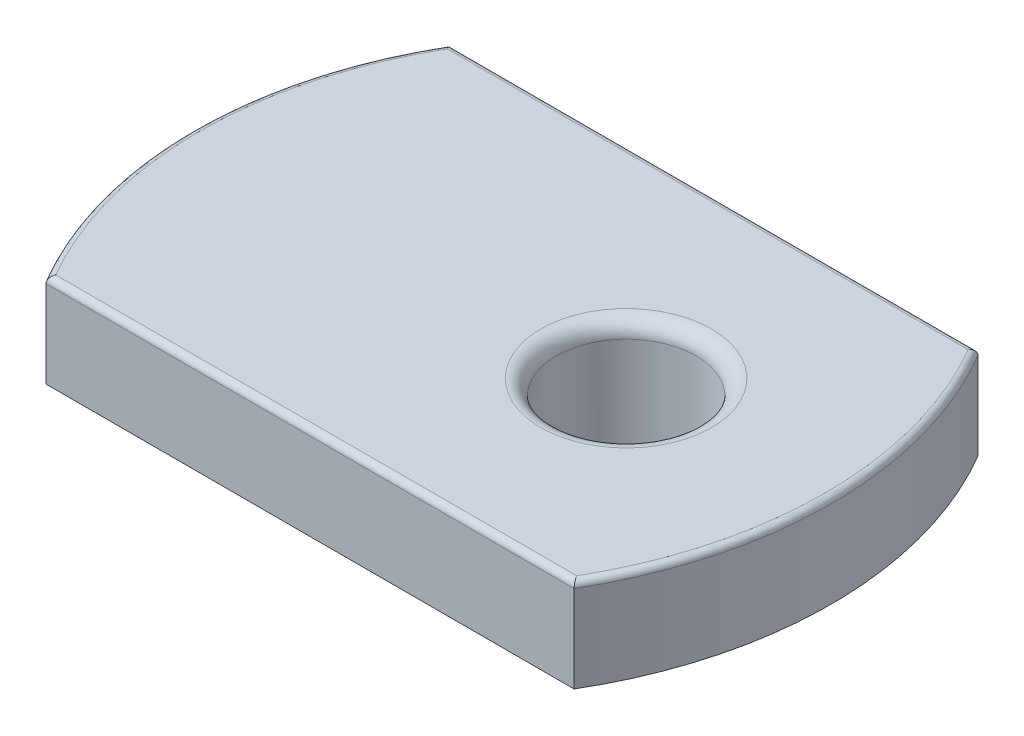
ISO-10303-21;
HEADER;
FILE_DESCRIPTION(('STEP AP214'),'2;1');
FILE_NAME('part.step','',(''),(''),'','','');
FILE_SCHEMA(('AUTOMOTIVE_DESIGN { 1 0 10303 214 1 1 1 1 }'));
ENDSEC;
DATA;
#1=APPLICATION_CONTEXT('core data for automotive mechanical design processes');
#2=APPLICATION_PROTOCOL_DEFINITION('international standard','automotive_design',2000,#1);
#3=PRODUCT_CONTEXT('',#1,'mechanical');
#4=PRODUCT('Part','Part','',(#3));
#5=PRODUCT_RELATED_PRODUCT_CATEGORY('part','',(#4));
#6=PRODUCT_DEFINITION_FORMATION('','',#4);
#7=PRODUCT_DEFINITION_CONTEXT('part definition',#1,'design');
#8=PRODUCT_DEFINITION('design','',#6,#7);
#9=PRODUCT_DEFINITION_SHAPE('','',#8);
#10=(LENGTH_UNIT() NAMED_UNIT(*) SI_UNIT(.MILLI.,.METRE.));
#11=(NAMED_UNIT(*) PLANE_ANGLE_UNIT() SI_UNIT($,.RADIAN.));
#12=(NAMED_UNIT(*) SI_UNIT($,.STERADIAN.) SOLID_ANGLE_UNIT());
#13=UNCERTAINTY_MEASURE_WITH_UNIT(LENGTH_MEASURE(1.E-05),#10,'distance_accuracy_value','');
#14=(GEOMETRIC_REPRESENTATION_CONTEXT(3) GLOBAL_UNCERTAINTY_ASSIGNED_CONTEXT((#13)) GLOBAL_UNIT_ASSIGNED_CONTEXT((#10,
#11,#12)) REPRESENTATION_CONTEXT('',''));
#15=CARTESIAN_POINT('',(0.,0.,0.));
#16=DIRECTION('',(0.,0.,1.));
#17=DIRECTION('',(1.,0.,0.));
#18=AXIS2_PLACEMENT_3D('',#15,#16,#17);
#19=CARTESIAN_POINT('',(-2.51390845070421,3.,0.));
#20=DIRECTION('',(0.,-1.,0.));
#21=DIRECTION('',(0.,0.,-1.));
#22=AXIS2_PLACEMENT_3D('',#19,#20,#21);
#23=CYLINDRICAL_SURFACE('',#22,12.7889084507042);
#24=DIRECTION('',(0.,-1.,0.));
#25=VECTOR('',#24,1.);
#26=CARTESIAN_POINT('',(8.5,3.,-6.5));
#27=LINE('',#26,#25);
#28=CARTESIAN_POINT('',(8.5,2.8,-6.5));
#29=VERTEX_POINT('',#28);
#30=CARTESIAN_POINT('',(8.5,0.,-6.5));
#31=VERTEX_POINT('',#30);
#32=EDGE_CURVE('E72',#29,#31,#27,.T.);
#33=ORIENTED_EDGE('',*,*,#32,.F.);
#34=CARTESIAN_POINT('',(-2.51390845070421,2.8,0.));
#35=DIRECTION('',(0.,-1.,0.));
#36=DIRECTION('',(0.,0.,-1.));
#37=AXIS2_PLACEMENT_3D('',#34,#35,#36);
#38=CIRCLE('',#37,12.7889084507042);
#39=CARTESIAN_POINT('',(8.5,2.8,6.5));
#40=VERTEX_POINT('',#39);
#41=EDGE_CURVE('E132',#29,#40,#38,.T.);
#42=ORIENTED_EDGE('',*,*,#41,.T.);
#43=DIRECTION('',(0.,-1.,0.));
#44=VECTOR('',#43,1.);
#45=CARTESIAN_POINT('',(8.5,3.,6.5));
#46=LINE('',#45,#44);
#47=CARTESIAN_POINT('',(8.5,0.,6.5));
#48=VERTEX_POINT('',#47);
#49=EDGE_CURVE('E92',#40,#48,#46,.T.);
#50=ORIENTED_EDGE('',*,*,#49,.T.);
#51=CARTESIAN_POINT('',(-2.51390845070421,0.,0.));
#52=DIRECTION('',(0.,1.,0.));
#53=DIRECTION('',(0.,0.,-1.));
#54=AXIS2_PLACEMENT_3D('',#51,#52,#53);
#55=CIRCLE('',#54,12.7889084507042);
#56=EDGE_CURVE('E87',#48,#31,#55,.T.);
#57=ORIENTED_EDGE('',*,*,#56,.T.);
#58=EDGE_LOOP('',(#33,#42,#50,#57));
#59=FACE_BOUND('',#58,.T.);
#60=ADVANCED_FACE('F16',(#59),#23,.T.);
#61=CARTESIAN_POINT('',(-8.5,3.,-6.5));
#62=DIRECTION('',(0.,0.,1.));
#63=DIRECTION('',(1.,0.,0.));
#64=AXIS2_PLACEMENT_3D('',#61,#62,#63);
#65=PLANE('',#64);
#66=DIRECTION('',(0.,-1.,0.));
#67=VECTOR('',#66,1.);
#68=CARTESIAN_POINT('',(-8.5,3.,-6.5));
#69=LINE('',#68,#67);
#70=CARTESIAN_POINT('',(-8.5,2.8,-6.5));
#71=VERTEX_POINT('',#70);
#72=CARTESIAN_POINT('',(-8.5,0.,-6.5));
#73=VERTEX_POINT('',#72);
#74=EDGE_CURVE('E81',#71,#73,#69,.T.);
#75=ORIENTED_EDGE('',*,*,#74,.F.);
#76=DIRECTION('',(-1.,0.,0.));
#77=VECTOR('',#76,1.);
#78=CARTESIAN_POINT('',(-8.5,2.8,-6.5));
#79=LINE('',#78,#77);
#80=EDGE_CURVE('E30',#71,#29,#79,.F.);
#81=ORIENTED_EDGE('',*,*,#80,.T.);
#82=ORIENTED_EDGE('',*,*,#32,.T.);
#83=DIRECTION('',(-1.,0.,0.));
#84=VECTOR('',#83,1.);
#85=CARTESIAN_POINT('',(-8.5,0.,-6.5));
#86=LINE('',#85,#84);
#87=EDGE_CURVE('E75',#31,#73,#86,.T.);
#88=ORIENTED_EDGE('',*,*,#87,.T.);
#89=EDGE_LOOP('',(#75,#81,#82,#88));
#90=FACE_BOUND('',#89,.T.);
#91=ADVANCED_FACE('F74',(#90),#65,.F.);
#92=CARTESIAN_POINT('',(2.51390845070421,3.,0.));
#93=DIRECTION('',(0.,-1.,0.));
#94=DIRECTION('',(0.,0.,-1.));
#95=AXIS2_PLACEMENT_3D('',#92,#93,#94);
#96=CYLINDRICAL_SURFACE('',#95,12.7889084507042);
#97=DIRECTION('',(0.,-1.,0.));
#98=VECTOR('',#97,1.);
#99=CARTESIAN_POINT('',(-8.5,3.,6.5));
#100=LINE('',#99,#98);
#101=CARTESIAN_POINT('',(-8.5,2.8,6.5));
#102=VERTEX_POINT('',#101);
#103=CARTESIAN_POINT('',(-8.5,0.,6.5));
#104=VERTEX_POINT('',#103);
#105=EDGE_CURVE('E103',#102,#104,#100,.T.);
#106=ORIENTED_EDGE('',*,*,#105,.F.);
#107=CARTESIAN_POINT('',(2.51390845070421,2.8,0.));
#108=DIRECTION('',(0.,-1.,0.));
#109=DIRECTION('',(0.,0.,-1.));
#110=AXIS2_PLACEMENT_3D('',#107,#108,#109);
#111=CIRCLE('',#110,12.7889084507042);
#112=EDGE_CURVE('E10',#102,#71,#111,.T.);
#113=ORIENTED_EDGE('',*,*,#112,.T.);
#114=ORIENTED_EDGE('',*,*,#74,.T.);
#115=CARTESIAN_POINT('',(2.51390845070421,0.,0.));
#116=DIRECTION('',(0.,1.,0.));
#117=DIRECTION('',(0.,0.,1.));
#118=AXIS2_PLACEMENT_3D('',#115,#116,#117);
#119=CIRCLE('',#118,12.7889084507042);
#120=EDGE_CURVE('E89',#73,#104,#119,.T.);
#121=ORIENTED_EDGE('',*,*,#120,.T.);
#122=EDGE_LOOP('',(#106,#113,#114,#121));
#123=FACE_BOUND('',#122,.T.);
#124=ADVANCED_FACE('F177',(#123),#96,.T.);
#125=CARTESIAN_POINT('',(-8.5,3.,6.5));
#126=DIRECTION('',(0.,0.,-1.));
#127=DIRECTION('',(-1.,0.,0.));
#128=AXIS2_PLACEMENT_3D('',#125,#126,#127);
#129=PLANE('',#128);
#130=ORIENTED_EDGE('',*,*,#49,.F.);
#131=DIRECTION('',(1.,0.,0.));
#132=VECTOR('',#131,1.);
#133=CARTESIAN_POINT('',(-8.5,2.8,6.5));
#134=LINE('',#133,#132);
#135=EDGE_CURVE('E129',#40,#102,#134,.F.);
#136=ORIENTED_EDGE('',*,*,#135,.T.);
#137=ORIENTED_EDGE('',*,*,#105,.T.);
#138=DIRECTION('',(1.,0.,0.));
#139=VECTOR('',#138,1.);
#140=CARTESIAN_POINT('',(-8.5,0.,6.5));
#141=LINE('',#140,#139);
#142=EDGE_CURVE('E100',#104,#48,#141,.T.);
#143=ORIENTED_EDGE('',*,*,#142,.T.);
#144=EDGE_LOOP('',(#130,#136,#137,#143));
#145=FACE_BOUND('',#144,.T.);
#146=ADVANCED_FACE('F176',(#145),#129,.F.);
#147=CARTESIAN_POINT('',(-2.51390845070421,3.,0.));
#148=DIRECTION('',(0.,-1.,0.));
#149=DIRECTION('',(0.,0.,-1.));
#150=AXIS2_PLACEMENT_3D('',#147,#148,#149);
#151=PLANE('',#150);
#152=CARTESIAN_POINT('',(2.51390845070421,3.,0.));
#153=DIRECTION('',(0.,-1.,0.));
#154=DIRECTION('',(0.,0.,-1.));
#155=AXIS2_PLACEMENT_3D('',#152,#153,#154);
#156=CIRCLE('',#155,12.5889084507042);
#157=CARTESIAN_POINT('',(-8.38520233780565,3.,-6.3));
#158=VERTEX_POINT('',#157);
#159=CARTESIAN_POINT('',(-8.38520233780565,3.,6.3));
#160=VERTEX_POINT('',#159);
#161=EDGE_CURVE('E120',#158,#160,#156,.F.);
#162=ORIENTED_EDGE('',*,*,#161,.T.);
#163=DIRECTION('',(1.,0.,0.));
#164=VECTOR('',#163,1.);
#165=CARTESIAN_POINT('',(-2.51390845070421,3.,6.3));
#166=LINE('',#165,#164);
#167=CARTESIAN_POINT('',(8.38520233780564,3.,6.3));
#168=VERTEX_POINT('',#167);
#169=EDGE_CURVE('E126',#160,#168,#166,.T.);
#170=ORIENTED_EDGE('',*,*,#169,.T.);
#171=CARTESIAN_POINT('',(-2.51390845070421,3.,0.));
#172=DIRECTION('',(0.,-1.,0.));
#173=DIRECTION('',(0.,0.,-1.));
#174=AXIS2_PLACEMENT_3D('',#171,#172,#173);
#175=CIRCLE('',#174,12.5889084507042);
#176=CARTESIAN_POINT('',(8.38520233780564,3.,-6.3));
#177=VERTEX_POINT('',#176);
#178=EDGE_CURVE('E124',#168,#177,#175,.F.);
#179=ORIENTED_EDGE('',*,*,#178,.T.);
#180=DIRECTION('',(-1.,0.,0.));
#181=VECTOR('',#180,1.);
#182=CARTESIAN_POINT('',(-2.51390845070421,3.,-6.3));
#183=LINE('',#182,#181);
#184=EDGE_CURVE('E122',#177,#158,#183,.T.);
#185=ORIENTED_EDGE('',*,*,#184,.T.);
#186=EDGE_LOOP('',(#162,#170,#179,#185));
#187=FACE_BOUND('',#186,.T.);
#188=CARTESIAN_POINT('',(3.675,3.,0.));
#189=DIRECTION('',(0.,-1.,0.));
#190=DIRECTION('',(0.,0.,-1.));
#191=AXIS2_PLACEMENT_3D('',#188,#189,#190);
#192=CIRCLE('',#191,2.75);
#193=CARTESIAN_POINT('',(3.675,3.,-2.75));
#194=VERTEX_POINT('',#193);
#195=EDGE_CURVE('E111',#194,#194,#192,.T.);
#196=ORIENTED_EDGE('',*,*,#195,.T.);
#197=EDGE_LOOP('',(#196));
#198=FACE_BOUND('',#197,.T.);
#199=ADVANCED_FACE('F181',(#187,#198),#151,.F.);
#200=CARTESIAN_POINT('',(-2.51390845070421,0.,0.));
#201=DIRECTION('',(0.,-1.,0.));
#202=DIRECTION('',(0.,0.,-1.));
#203=AXIS2_PLACEMENT_3D('',#200,#201,#202);
#204=PLANE('',#203);
#205=CARTESIAN_POINT('',(3.675,0.,0.));
#206=DIRECTION('',(0.,-1.,0.));
#207=DIRECTION('',(0.,0.,-1.));
#208=AXIS2_PLACEMENT_3D('',#205,#206,#207);
#209=CIRCLE('',#208,3.2);
#210=CARTESIAN_POINT('',(3.675,0.,-3.2));
#211=VERTEX_POINT('',#210);
#212=EDGE_CURVE('E80',#211,#211,#209,.T.);
#213=ORIENTED_EDGE('',*,*,#212,.F.);
#214=EDGE_LOOP('',(#213));
#215=FACE_BOUND('',#214,.T.);
#216=ORIENTED_EDGE('',*,*,#56,.F.);
#217=ORIENTED_EDGE('',*,*,#142,.F.);
#218=ORIENTED_EDGE('',*,*,#120,.F.);
#219=ORIENTED_EDGE('',*,*,#87,.F.);
#220=EDGE_LOOP('',(#216,#217,#218,#219));
#221=FACE_BOUND('',#220,.T.);
#222=ADVANCED_FACE('F85',(#215,#221),#204,.T.);
#223=CARTESIAN_POINT('',(3.675,-2.1,0.));
#224=DIRECTION('',(0.,1.,0.));
#225=DIRECTION('',(0.,0.,1.));
#226=AXIS2_PLACEMENT_3D('',#223,#224,#225);
#227=CYLINDRICAL_SURFACE('',#226,3.2);
#228=CARTESIAN_POINT('',(3.675,-1.6,0.));
#229=DIRECTION('',(0.,1.,0.));
#230=DIRECTION('',(0.,0.,1.));
#231=AXIS2_PLACEMENT_3D('',#228,#229,#230);
#232=CIRCLE('',#231,3.2);
#233=CARTESIAN_POINT('',(3.675,-1.6,3.2));
#234=VERTEX_POINT('',#233);
#235=EDGE_CURVE('E114',#234,#234,#232,.T.);
#236=ORIENTED_EDGE('',*,*,#235,.T.);
#237=EDGE_LOOP('',(#236));
#238=FACE_BOUND('',#237,.T.);
#239=ORIENTED_EDGE('',*,*,#212,.T.);
#240=EDGE_LOOP('',(#239));
#241=FACE_BOUND('',#240,.T.);
#242=ADVANCED_FACE('F202',(#238,#241),#227,.T.);
#243=CARTESIAN_POINT('',(3.675,-2.1,0.));
#244=DIRECTION('',(0.,1.,0.));
#245=DIRECTION('',(0.,0.,1.));
#246=AXIS2_PLACEMENT_3D('',#243,#244,#245);
#247=PLANE('',#246);
#248=CARTESIAN_POINT('',(3.675,-2.1,0.));
#249=DIRECTION('',(0.,1.,0.));
#250=DIRECTION('',(0.,0.,1.));
#251=AXIS2_PLACEMENT_3D('',#248,#249,#250);
#252=CIRCLE('',#251,2.7);
#253=CARTESIAN_POINT('',(3.675,-2.1,2.7));
#254=VERTEX_POINT('',#253);
#255=EDGE_CURVE('E117',#254,#254,#252,.F.);
#256=ORIENTED_EDGE('',*,*,#255,.T.);
#257=EDGE_LOOP('',(#256));
#258=FACE_BOUND('',#257,.T.);
#259=CARTESIAN_POINT('',(3.675,-2.1,0.));
#260=DIRECTION('',(0.,1.,0.));
#261=DIRECTION('',(0.,0.,1.));
#262=AXIS2_PLACEMENT_3D('',#259,#260,#261);
#263=CIRCLE('',#262,2.25);
#264=CARTESIAN_POINT('',(3.675,-2.1,2.25));
#265=VERTEX_POINT('',#264);
#266=EDGE_CURVE('E94',#265,#265,#263,.T.);
#267=ORIENTED_EDGE('',*,*,#266,.T.);
#268=EDGE_LOOP('',(#267));
#269=FACE_BOUND('',#268,.T.);
#270=ADVANCED_FACE('F197',(#258,#269),#247,.F.);
#271=CARTESIAN_POINT('',(3.675,-2.1,0.));
#272=DIRECTION('',(0.,1.,0.));
#273=DIRECTION('',(0.,0.,1.));
#274=AXIS2_PLACEMENT_3D('',#271,#272,#273);
#275=CYLINDRICAL_SURFACE('',#274,2.25);
#276=CARTESIAN_POINT('',(3.675,2.5,0.));
#277=DIRECTION('',(0.,-1.,0.));
#278=DIRECTION('',(0.,0.,-1.));
#279=AXIS2_PLACEMENT_3D('',#276,#277,#278);
#280=CIRCLE('',#279,2.25);
#281=CARTESIAN_POINT('',(3.675,2.5,-2.25));
#282=VERTEX_POINT('',#281);
#283=EDGE_CURVE('E108',#282,#282,#280,.F.);
#284=ORIENTED_EDGE('',*,*,#283,.T.);
#285=EDGE_LOOP('',(#284));
#286=FACE_BOUND('',#285,.T.);
#287=ORIENTED_EDGE('',*,*,#266,.F.);
#288=EDGE_LOOP('',(#287));
#289=FACE_BOUND('',#288,.T.);
#290=ADVANCED_FACE('F191',(#286,#289),#275,.F.);
#291=CARTESIAN_POINT('',(3.675,2.5,0.));
#292=DIRECTION('',(0.,-1.,0.));
#293=DIRECTION('',(0.,0.,-1.));
#294=AXIS2_PLACEMENT_3D('',#291,#292,#293);
#295=TOROIDAL_SURFACE('',#294,2.75,0.5);
#296=ORIENTED_EDGE('',*,*,#195,.F.);
#297=EDGE_LOOP('',(#296));
#298=FACE_BOUND('',#297,.T.);
#299=ORIENTED_EDGE('',*,*,#283,.F.);
#300=EDGE_LOOP('',(#299));
#301=FACE_BOUND('',#300,.T.);
#302=ADVANCED_FACE('F187',(#298,#301),#295,.T.);
#303=CARTESIAN_POINT('',(3.675,-1.6,0.));
#304=DIRECTION('',(0.,1.,0.));
#305=DIRECTION('',(0.,0.,1.));
#306=AXIS2_PLACEMENT_3D('',#303,#304,#305);
#307=CONICAL_SURFACE('',#306,3.2,0.785398163397447);
#308=ORIENTED_EDGE('',*,*,#255,.F.);
#309=EDGE_LOOP('',(#308));
#310=FACE_BOUND('',#309,.T.);
#311=ORIENTED_EDGE('',*,*,#235,.F.);
#312=EDGE_LOOP('',(#311));
#313=FACE_BOUND('',#312,.T.);
#314=ADVANCED_FACE('F190',(#310,#313),#307,.T.);
#315=CARTESIAN_POINT('',(-2.51390845070421,2.8,-6.3));
#316=DIRECTION('',(-1.,0.,0.));
#317=DIRECTION('',(0.,0.,1.));
#318=AXIS2_PLACEMENT_3D('',#315,#316,#317);
#319=CYLINDRICAL_SURFACE('',#318,0.2);
#320=CARTESIAN_POINT('',(8.5,2.8,-6.5));
#321=CARTESIAN_POINT('',(8.50000745142995,2.81019444334544,-6.50001322642434));
#322=CARTESIAN_POINT('',(8.49955547827552,2.82037757743437,-6.49922149853345));
#323=CARTESIAN_POINT('',(8.49779293995873,2.84039452977053,-6.49613500546002));
#324=CARTESIAN_POINT('',(8.49648601160734,2.85022964246567,-6.49384660682913));
#325=CARTESIAN_POINT('',(8.49307432190245,2.86930694502015,-6.48787450021161));
#326=CARTESIAN_POINT('',(8.4909702191424,2.87854961698036,-6.48419194402377));
#327=CARTESIAN_POINT('',(8.4860566186447,2.8962442985565,-6.47559561432051));
#328=CARTESIAN_POINT('',(8.48324655867504,2.90469567057321,-6.47068085947503));
#329=CARTESIAN_POINT('',(8.47686815790181,2.92104927868067,-6.45953037516586));
#330=CARTESIAN_POINT('',(8.47326869645224,2.92890224856563,-6.45324048107905));
#331=CARTESIAN_POINT('',(8.46552889010423,2.94344359196812,-6.43972324226624));
#332=CARTESIAN_POINT('',(8.46138839823726,2.95013164788608,-6.43249564282054));
#333=CARTESIAN_POINT('',(8.45213634196745,2.96303694169002,-6.41635552421829));
#334=CARTESIAN_POINT('',(8.44696807842534,2.96909117307684,-6.40734530178684));
#335=CARTESIAN_POINT('',(8.43623499606682,2.97960163836564,-6.38864787024181));
#336=CARTESIAN_POINT('',(8.43066980427347,2.98405634490289,-6.37896002456344));
#337=CARTESIAN_POINT('',(8.41880165220961,2.99165085105328,-6.35831664982718));
#338=CARTESIAN_POINT('',(8.41247586551277,2.9946500625686,-6.34732277020165));
#339=CARTESIAN_POINT('',(8.39967401938257,2.99874012286163,-6.32509382323473));
#340=CARTESIAN_POINT('',(8.3931982841202,2.99983475824154,-6.31385927951961));
#341=CARTESIAN_POINT('',(8.38621509526965,2.9999942322665,-6.30175523895919));
#342=CARTESIAN_POINT('',(8.38570870064733,3.00000000935386,-6.30087756101489));
#343=CARTESIAN_POINT('',(8.38520233780564,3.,-6.3));
#344=B_SPLINE_CURVE_WITH_KNOTS('',3,(#320,#321,#322,#323,#324,#325,#326,#327,#328,#329,#330,
#331,#332,#333,#334,#335,#336,#337,#338,#339,#340,#341,#342,#343),.UNSPECIFIED.,.F.,.F.,(4,2,2,
2,2,2,2,2,2,2,2,4),(0.,0.0305248933990669,0.0609207769421134,0.0912916031946474,
0.121686694209429,0.153616341405145,0.18555468024975,0.221480142433116,0.257439818695238,
0.296397481413258,0.335277601177469,0.338317439998827),.UNSPECIFIED.);
#345=EDGE_CURVE('E158',#29,#177,#344,.T.);
#346=ORIENTED_EDGE('',*,*,#345,.F.);
#347=ORIENTED_EDGE('',*,*,#80,.F.);
#348=CARTESIAN_POINT('',(-8.5,2.8,-6.5));
#349=CARTESIAN_POINT('',(-8.50000745142995,2.81019444334544,-6.50001322642434));
#350=CARTESIAN_POINT('',(-8.49955547827552,2.82037757743437,-6.49922149853345));
#351=CARTESIAN_POINT('',(-8.49779293995873,2.84039452977053,-6.49613500546002));
#352=CARTESIAN_POINT('',(-8.49648601160734,2.85022964246567,-6.49384660682913));
#353=CARTESIAN_POINT('',(-8.49307432190246,2.86930694502015,-6.48787450021161));
#354=CARTESIAN_POINT('',(-8.4909702191424,2.87854961698036,-6.48419194402377));
#355=CARTESIAN_POINT('',(-8.4860566186447,2.8962442985565,-6.47559561432051));
#356=CARTESIAN_POINT('',(-8.48324655867504,2.90469567057321,-6.47068085947503));
#357=CARTESIAN_POINT('',(-8.47686815790181,2.92104927868067,-6.45953037516586));
#358=CARTESIAN_POINT('',(-8.47326869645224,2.92890224856563,-6.45324048107905));
#359=CARTESIAN_POINT('',(-8.46552889010423,2.94344359196812,-6.43972324226624));
#360=CARTESIAN_POINT('',(-8.46138839823727,2.95013164788608,-6.43249564282054));
#361=CARTESIAN_POINT('',(-8.45213634196745,2.96303694169002,-6.41635552421829));
#362=CARTESIAN_POINT('',(-8.44696807842534,2.96909117307684,-6.40734530178684));
#363=CARTESIAN_POINT('',(-8.43623499606683,2.97960163836564,-6.38864787024181));
#364=CARTESIAN_POINT('',(-8.43066980427348,2.9840563449029,-6.37896002456344));
#365=CARTESIAN_POINT('',(-8.41880165220962,2.99165085105328,-6.35831664982718));
#366=CARTESIAN_POINT('',(-8.41247586551277,2.9946500625686,-6.34732277020165));
#367=CARTESIAN_POINT('',(-8.39967401938256,2.99874012286163,-6.32509382323474));
#368=CARTESIAN_POINT('',(-8.39319828412019,2.99983475824154,-6.31385927951962));
#369=CARTESIAN_POINT('',(-8.38621509526965,2.9999942322665,-6.30175523895919));
#370=CARTESIAN_POINT('',(-8.38570870064733,3.00000000935386,-6.30087756101489));
#371=CARTESIAN_POINT('',(-8.38520233780565,3.,-6.3));
#372=B_SPLINE_CURVE_WITH_KNOTS('',3,(#348,#349,#350,#351,#352,#353,#354,#355,#356,#357,#358,
#359,#360,#361,#362,#363,#364,#365,#366,#367,#368,#369,#370,#371),.UNSPECIFIED.,.F.,.F.,(4,2,2,
2,2,2,2,2,2,2,2,4),(0.,0.0305248933990672,0.0609207769421135,0.0912916031946468,
0.121686694209429,0.153616341405145,0.185554680249751,0.221480142433115,0.257439818695238,
0.296397481413259,0.335277601177468,0.338317439998826),.UNSPECIFIED.);
#373=EDGE_CURVE('E21',#158,#71,#372,.F.);
#374=ORIENTED_EDGE('',*,*,#373,.F.);
#375=ORIENTED_EDGE('',*,*,#184,.F.);
#376=EDGE_LOOP('',(#346,#347,#374,#375));
#377=FACE_BOUND('',#376,.T.);
#378=ADVANCED_FACE('F18',(#377),#319,.T.);
#379=CARTESIAN_POINT('',(2.51390845070421,2.8,0.));
#380=DIRECTION('',(0.,-1.,0.));
#381=DIRECTION('',(0.,0.,-1.));
#382=AXIS2_PLACEMENT_3D('',#379,#380,#381);
#383=TOROIDAL_SURFACE('',#382,12.5889084507042,0.2);
#384=ORIENTED_EDGE('',*,*,#373,.T.);
#385=ORIENTED_EDGE('',*,*,#112,.F.);
#386=CARTESIAN_POINT('',(-8.5,2.8,6.5));
#387=CARTESIAN_POINT('',(-8.50000745142995,2.81019444334544,6.50001322642434));
#388=CARTESIAN_POINT('',(-8.49955547827552,2.82037757743437,6.49922149853345));
#389=CARTESIAN_POINT('',(-8.49779293995873,2.84039452977053,6.49613500546002));
#390=CARTESIAN_POINT('',(-8.49648601160734,2.85022964246567,6.49384660682913));
#391=CARTESIAN_POINT('',(-8.49307432190246,2.86930694502015,6.48787450021161));
#392=CARTESIAN_POINT('',(-8.4909702191424,2.87854961698036,6.48419194402377));
#393=CARTESIAN_POINT('',(-8.4860566186447,2.8962442985565,6.47559561432051));
#394=CARTESIAN_POINT('',(-8.48324655867504,2.90469567057321,6.47068085947503));
#395=CARTESIAN_POINT('',(-8.47686815790181,2.92104927868067,6.45953037516586));
#396=CARTESIAN_POINT('',(-8.47326869645224,2.92890224856563,6.45324048107905));
#397=CARTESIAN_POINT('',(-8.46552889010423,2.94344359196812,6.43972324226624));
#398=CARTESIAN_POINT('',(-8.46138839823727,2.95013164788608,6.43249564282054));
#399=CARTESIAN_POINT('',(-8.45213634196745,2.96303694169002,6.41635552421829));
#400=CARTESIAN_POINT('',(-8.44696807842534,2.96909117307684,6.40734530178684));
#401=CARTESIAN_POINT('',(-8.43623499606683,2.97960163836564,6.38864787024181));
#402=CARTESIAN_POINT('',(-8.43066980427348,2.9840563449029,6.37896002456344));
#403=CARTESIAN_POINT('',(-8.41880165220962,2.99165085105328,6.35831664982718));
#404=CARTESIAN_POINT('',(-8.41247586551277,2.9946500625686,6.34732277020165));
#405=CARTESIAN_POINT('',(-8.39967401938256,2.99874012286163,6.32509382323474));
#406=CARTESIAN_POINT('',(-8.39319828412019,2.99983475824154,6.31385927951962));
#407=CARTESIAN_POINT('',(-8.38621509526965,2.9999942322665,6.30175523895919));
#408=CARTESIAN_POINT('',(-8.38570870064733,3.00000000935386,6.30087756101489));
#409=CARTESIAN_POINT('',(-8.38520233780565,3.,6.3));
#410=B_SPLINE_CURVE_WITH_KNOTS('',3,(#386,#387,#388,#389,#390,#391,#392,#393,#394,#395,#396,
#397,#398,#399,#400,#401,#402,#403,#404,#405,#406,#407,#408,#409),.UNSPECIFIED.,.F.,.F.,(4,2,2,
2,2,2,2,2,2,2,2,4),(0.,0.0305248933990672,0.0609207769421135,0.0912916031946467,
0.121686694209429,0.153616341405145,0.185554680249751,0.221480142433115,0.257439818695238,
0.296397481413259,0.335277601177468,0.338317439998826),.UNSPECIFIED.);
#411=EDGE_CURVE('E143',#160,#102,#410,.F.);
#412=ORIENTED_EDGE('',*,*,#411,.F.);
#413=ORIENTED_EDGE('',*,*,#161,.F.);
#414=EDGE_LOOP('',(#384,#385,#412,#413));
#415=FACE_BOUND('',#414,.T.);
#416=ADVANCED_FACE('F154',(#415),#383,.T.);
#417=CARTESIAN_POINT('',(-2.51390845070421,2.8,0.));
#418=DIRECTION('',(0.,-1.,0.));
#419=DIRECTION('',(0.,0.,-1.));
#420=AXIS2_PLACEMENT_3D('',#417,#418,#419);
#421=TOROIDAL_SURFACE('',#420,12.5889084507042,0.2);
#422=ORIENTED_EDGE('',*,*,#345,.T.);
#423=ORIENTED_EDGE('',*,*,#178,.F.);
#424=CARTESIAN_POINT('',(8.5,2.8,6.5));
#425=CARTESIAN_POINT('',(8.50000745142995,2.81019444334544,6.50001322642434));
#426=CARTESIAN_POINT('',(8.49955547827552,2.82037757743437,6.49922149853345));
#427=CARTESIAN_POINT('',(8.49779293995873,2.84039452977053,6.49613500546002));
#428=CARTESIAN_POINT('',(8.49648601160734,2.85022964246567,6.49384660682913));
#429=CARTESIAN_POINT('',(8.49307432190245,2.86930694502015,6.48787450021161));
#430=CARTESIAN_POINT('',(8.4909702191424,2.87854961698036,6.48419194402377));
#431=CARTESIAN_POINT('',(8.4860566186447,2.8962442985565,6.47559561432051));
#432=CARTESIAN_POINT('',(8.48324655867504,2.90469567057321,6.47068085947503));
#433=CARTESIAN_POINT('',(8.47686815790181,2.92104927868067,6.45953037516586));
#434=CARTESIAN_POINT('',(8.47326869645224,2.92890224856563,6.45324048107905));
#435=CARTESIAN_POINT('',(8.46552889010423,2.94344359196812,6.43972324226624));
#436=CARTESIAN_POINT('',(8.46138839823726,2.95013164788608,6.43249564282054));
#437=CARTESIAN_POINT('',(8.45213634196745,2.96303694169002,6.41635552421829));
#438=CARTESIAN_POINT('',(8.44696807842534,2.96909117307684,6.40734530178684));
#439=CARTESIAN_POINT('',(8.43623499606682,2.97960163836564,6.38864787024181));
#440=CARTESIAN_POINT('',(8.43066980427347,2.98405634490289,6.37896002456344));
#441=CARTESIAN_POINT('',(8.41880165220961,2.99165085105328,6.35831664982718));
#442=CARTESIAN_POINT('',(8.41247586551277,2.9946500625686,6.34732277020165));
#443=CARTESIAN_POINT('',(8.39967401938257,2.99874012286163,6.32509382323473));
#444=CARTESIAN_POINT('',(8.3931982841202,2.99983475824154,6.31385927951961));
#445=CARTESIAN_POINT('',(8.38621509526965,2.9999942322665,6.30175523895919));
#446=CARTESIAN_POINT('',(8.38570870064733,3.00000000935386,6.30087756101489));
#447=CARTESIAN_POINT('',(8.38520233780564,3.,6.3));
#448=B_SPLINE_CURVE_WITH_KNOTS('',3,(#424,#425,#426,#427,#428,#429,#430,#431,#432,#433,#434,
#435,#436,#437,#438,#439,#440,#441,#442,#443,#444,#445,#446,#447),.UNSPECIFIED.,.F.,.F.,(4,2,2,
2,2,2,2,2,2,2,2,4),(0.,0.0305248933990669,0.0609207769421134,0.0912916031946474,
0.121686694209429,0.153616341405145,0.18555468024975,0.221480142433116,0.257439818695238,
0.296397481413258,0.335277601177469,0.338317439998827),.UNSPECIFIED.);
#449=EDGE_CURVE('E135',#40,#168,#448,.T.);
#450=ORIENTED_EDGE('',*,*,#449,.F.);
#451=ORIENTED_EDGE('',*,*,#41,.F.);
#452=EDGE_LOOP('',(#422,#423,#450,#451));
#453=FACE_BOUND('',#452,.T.);
#454=ADVANCED_FACE('F151',(#453),#421,.T.);
#455=CARTESIAN_POINT('',(-2.51390845070421,2.8,6.3));
#456=DIRECTION('',(1.,0.,0.));
#457=DIRECTION('',(0.,0.,-1.));
#458=AXIS2_PLACEMENT_3D('',#455,#456,#457);
#459=CYLINDRICAL_SURFACE('',#458,0.2);
#460=ORIENTED_EDGE('',*,*,#411,.T.);
#461=ORIENTED_EDGE('',*,*,#135,.F.);
#462=ORIENTED_EDGE('',*,*,#449,.T.);
#463=ORIENTED_EDGE('',*,*,#169,.F.);
#464=EDGE_LOOP('',(#460,#461,#462,#463));
#465=FACE_BOUND('',#464,.T.);
#466=ADVANCED_FACE('F148',(#465),#459,.T.);
#467=CLOSED_SHELL('',(#60,#91,#124,#146,#199,#222,#242,#270,#290,#302,#314,#378,#416,#454,#466));
#468=MANIFOLD_SOLID_BREP('B1',#467);
#469=ADVANCED_BREP_SHAPE_REPRESENTATION('',(#18,#468),#14);
#470=SHAPE_DEFINITION_REPRESENTATION(#9,#469);
ENDSEC;
END-ISO-10303-21;
